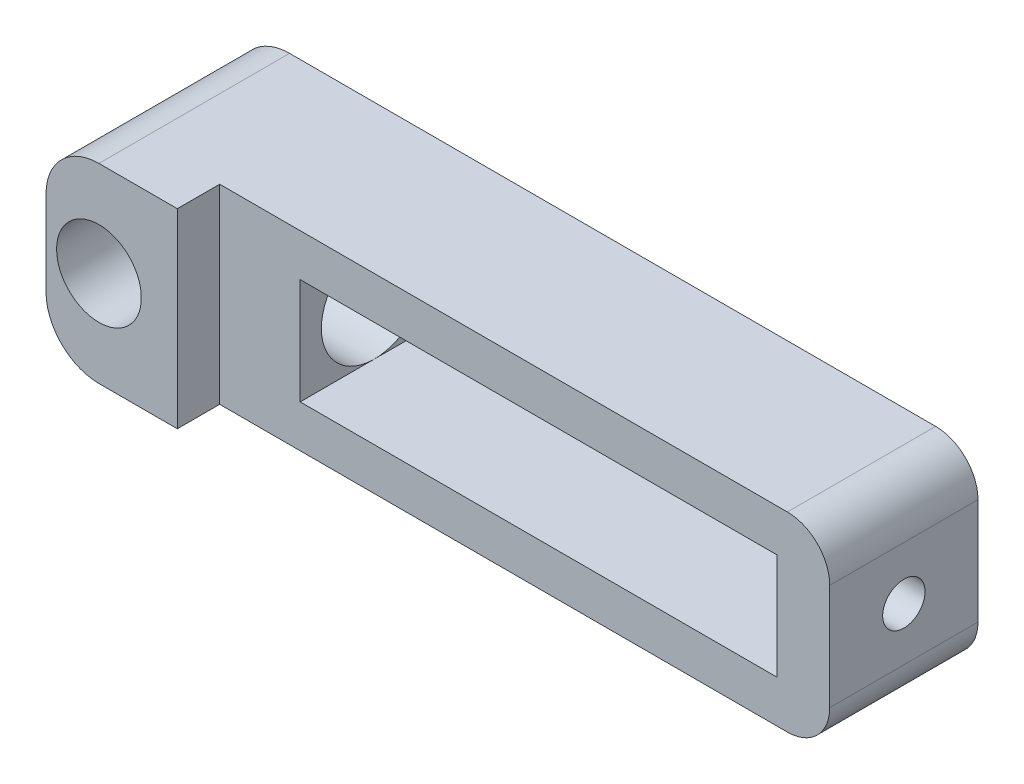
ISO-10303-21;
HEADER;
FILE_DESCRIPTION(('STEP AP214'),'2;1');
FILE_NAME('part.step','',(''),(''),'','','');
FILE_SCHEMA(('AUTOMOTIVE_DESIGN { 1 0 10303 214 1 1 1 1 }'));
ENDSEC;
DATA;
#1=APPLICATION_CONTEXT('core data for automotive mechanical design processes');
#2=APPLICATION_PROTOCOL_DEFINITION('international standard','automotive_design',2000,#1);
#3=PRODUCT_CONTEXT('',#1,'mechanical');
#4=PRODUCT('Part','Part','',(#3));
#5=PRODUCT_RELATED_PRODUCT_CATEGORY('part','',(#4));
#6=PRODUCT_DEFINITION_FORMATION('','',#4);
#7=PRODUCT_DEFINITION_CONTEXT('part definition',#1,'design');
#8=PRODUCT_DEFINITION('design','',#6,#7);
#9=PRODUCT_DEFINITION_SHAPE('','',#8);
#10=(LENGTH_UNIT() NAMED_UNIT(*) SI_UNIT(.MILLI.,.METRE.));
#11=(NAMED_UNIT(*) PLANE_ANGLE_UNIT() SI_UNIT($,.RADIAN.));
#12=(NAMED_UNIT(*) SI_UNIT($,.STERADIAN.) SOLID_ANGLE_UNIT());
#13=UNCERTAINTY_MEASURE_WITH_UNIT(LENGTH_MEASURE(1.E-05),#10,'distance_accuracy_value','');
#14=(GEOMETRIC_REPRESENTATION_CONTEXT(3) GLOBAL_UNCERTAINTY_ASSIGNED_CONTEXT((#13)) GLOBAL_UNIT_ASSIGNED_CONTEXT((#10,
#11,#12)) REPRESENTATION_CONTEXT('',''));
#15=CARTESIAN_POINT('',(0.,0.,0.));
#16=DIRECTION('',(0.,0.,1.));
#17=DIRECTION('',(1.,0.,0.));
#18=AXIS2_PLACEMENT_3D('',#15,#16,#17);
#19=CARTESIAN_POINT('',(0.,0.,7.));
#20=DIRECTION('',(1.,0.,0.));
#21=DIRECTION('',(0.,1.,0.));
#22=AXIS2_PLACEMENT_3D('',#19,#20,#21);
#23=PLANE('',#22);
#24=DIRECTION('',(0.,-1.,0.));
#25=VECTOR('',#24,1.);
#26=CARTESIAN_POINT('',(0.,-9.,9.));
#27=LINE('',#26,#25);
#28=CARTESIAN_POINT('',(0.,-2.5,9.));
#29=VERTEX_POINT('',#28);
#30=CARTESIAN_POINT('',(0.,-6.5,9.));
#31=VERTEX_POINT('',#30);
#32=EDGE_CURVE('E589',#29,#31,#27,.T.);
#33=ORIENTED_EDGE('',*,*,#32,.F.);
#34=DIRECTION('',(0.,0.,-1.));
#35=VECTOR('',#34,1.);
#36=CARTESIAN_POINT('',(0.,-2.5,7.));
#37=LINE('',#36,#35);
#38=CARTESIAN_POINT('',(0.,-2.5,5.));
#39=VERTEX_POINT('',#38);
#40=EDGE_CURVE('E386',#29,#39,#37,.T.);
#41=ORIENTED_EDGE('',*,*,#40,.T.);
#42=CARTESIAN_POINT('',(0.,-4.5,3.5));
#43=DIRECTION('',(1.,0.,0.));
#44=DIRECTION('',(0.,1.,0.));
#45=AXIS2_PLACEMENT_3D('',#42,#43,#44);
#46=CIRCLE('',#45,2.5);
#47=CARTESIAN_POINT('',(0.,-6.5,5.));
#48=VERTEX_POINT('',#47);
#49=EDGE_CURVE('E309',#48,#39,#46,.F.);
#50=ORIENTED_EDGE('',*,*,#49,.F.);
#51=DIRECTION('',(0.,0.,-1.));
#52=VECTOR('',#51,1.);
#53=CARTESIAN_POINT('',(0.,-6.5,7.));
#54=LINE('',#53,#52);
#55=EDGE_CURVE('E392',#48,#31,#54,.F.);
#56=ORIENTED_EDGE('',*,*,#55,.T.);
#57=EDGE_LOOP('',(#33,#41,#50,#56));
#58=FACE_BOUND('',#57,.T.);
#59=ADVANCED_FACE('F41',(#58),#23,.F.);
#60=CARTESIAN_POINT('',(10.,-2.,7.));
#61=DIRECTION('',(1.,0.,0.));
#62=DIRECTION('',(0.,0.,-1.));
#63=AXIS2_PLACEMENT_3D('',#60,#61,#62);
#64=PLANE('',#63);
#65=CARTESIAN_POINT('',(10.,-4.5,3.5));
#66=DIRECTION('',(1.,0.,0.));
#67=DIRECTION('',(0.,0.,-1.));
#68=AXIS2_PLACEMENT_3D('',#65,#66,#67);
#69=CIRCLE('',#68,2.5);
#70=CARTESIAN_POINT('',(10.,-2.,3.5));
#71=VERTEX_POINT('',#70);
#72=CARTESIAN_POINT('',(10.,-7.,3.5));
#73=VERTEX_POINT('',#72);
#74=EDGE_CURVE('E459',#71,#73,#69,.T.);
#75=ORIENTED_EDGE('',*,*,#74,.F.);
#76=DIRECTION('',(0.,0.,-1.));
#77=VECTOR('',#76,1.);
#78=CARTESIAN_POINT('',(10.,-2.,7.));
#79=LINE('',#78,#77);
#80=CARTESIAN_POINT('',(10.,-2.,7.));
#81=VERTEX_POINT('',#80);
#82=EDGE_CURVE('E260',#81,#71,#79,.T.);
#83=ORIENTED_EDGE('',*,*,#82,.F.);
#84=DIRECTION('',(0.,-1.,0.));
#85=VECTOR('',#84,1.);
#86=CARTESIAN_POINT('',(10.,-2.,7.));
#87=LINE('',#86,#85);
#88=CARTESIAN_POINT('',(10.,-7.,7.));
#89=VERTEX_POINT('',#88);
#90=EDGE_CURVE('E269',#81,#89,#87,.T.);
#91=ORIENTED_EDGE('',*,*,#90,.T.);
#92=DIRECTION('',(0.,0.,-1.));
#93=VECTOR('',#92,1.);
#94=CARTESIAN_POINT('',(10.,-7.,7.));
#95=LINE('',#94,#93);
#96=EDGE_CURVE('E236',#89,#73,#95,.T.);
#97=ORIENTED_EDGE('',*,*,#96,.T.);
#98=EDGE_LOOP('',(#75,#83,#91,#97));
#99=FACE_BOUND('',#98,.T.);
#100=ADVANCED_FACE('F345',(#99),#64,.T.);
#101=CARTESIAN_POINT('',(2.5,-4.5,7.));
#102=DIRECTION('',(0.,0.,-1.));
#103=DIRECTION('',(-1.,0.,0.));
#104=AXIS2_PLACEMENT_3D('',#101,#102,#103);
#105=CYLINDRICAL_SURFACE('',#104,2.);
#106=CARTESIAN_POINT('',(2.5,-4.5,9.));
#107=DIRECTION('',(0.,0.,-1.));
#108=DIRECTION('',(-1.,0.,0.));
#109=AXIS2_PLACEMENT_3D('',#106,#107,#108);
#110=CIRCLE('',#109,2.);
#111=CARTESIAN_POINT('',(0.5,-4.5,9.));
#112=VERTEX_POINT('',#111);
#113=EDGE_CURVE('E178',#112,#112,#110,.T.);
#114=ORIENTED_EDGE('',*,*,#113,.F.);
#115=EDGE_LOOP('',(#114));
#116=FACE_BOUND('',#115,.T.);
#117=CARTESIAN_POINT('',(0.5,-4.5,6.));
#118=CARTESIAN_POINT('',(0.500007579432928,-4.40400310356113,5.99999264947401));
#119=CARTESIAN_POINT('',(0.506969428663558,-4.30786680703533,5.99441368411908));
#120=CARTESIAN_POINT('',(0.534349940041729,-4.11868063452259,5.97259269360604));
#121=CARTESIAN_POINT('',(0.554798371261927,-4.02563806567866,5.95632708000382));
#122=CARTESIAN_POINT('',(0.607678278895069,-3.84590508317549,5.9146672181517));
#123=CARTESIAN_POINT('',(0.640033351431378,-3.75917830187195,5.88933120144167));
#124=CARTESIAN_POINT('',(0.715117343477346,-3.59307367630746,5.83136010996601));
#125=CARTESIAN_POINT('',(0.757846295850589,-3.51369585532849,5.79872501207752));
#126=CARTESIAN_POINT('',(0.868628365031063,-3.33681876343297,5.71575664728952));
#127=CARTESIAN_POINT('',(0.940318915174065,-3.24263232047885,5.66321748603216));
#128=CARTESIAN_POINT('',(1.0972780657395,-3.06958632172117,5.55292192603027));
#129=CARTESIAN_POINT('',(1.18258575350337,-2.99077238466846,5.49515072200505));
#130=CARTESIAN_POINT('',(1.36677398407267,-2.8478408104446,5.37856001629835));
#131=CARTESIAN_POINT('',(1.46584677297612,-2.78397361542778,5.31973830902028));
#132=CARTESIAN_POINT('',(1.67653878250419,-2.67353165586396,5.2088210988299));
#133=CARTESIAN_POINT('',(1.788114333888,-2.62689900613599,5.15670347089169));
#134=CARTESIAN_POINT('',(1.97387895167698,-2.56913956228181,5.08835652300928));
#135=CARTESIAN_POINT('',(2.04381173798029,-2.55134524179342,5.06628727770188));
#136=CARTESIAN_POINT('',(2.18721268412047,-2.52326603201669,5.03069889155832));
#137=CARTESIAN_POINT('',(2.260671673525,-2.51296268118224,5.0171587417974));
#138=CARTESIAN_POINT('',(2.41019251887104,-2.50060159857446,5.00084234061103));
#139=CARTESIAN_POINT('',(2.4862714848208,-2.49861654386577,4.99816096926556));
#140=CARTESIAN_POINT('',(2.63770489203275,-2.50330518300315,5.00439962302809));
#141=CARTESIAN_POINT('',(2.7130586657663,-2.50998620488913,5.01332946660241));
#142=CARTESIAN_POINT('',(2.87222230261273,-2.5330469728806,5.0432072129997));
#143=CARTESIAN_POINT('',(2.955508006054,-2.55078191794379,5.06581842049528));
#144=CARTESIAN_POINT('',(3.11653555953704,-2.59555452651152,5.11997459936279));
#145=CARTESIAN_POINT('',(3.19426015653982,-2.62261974357749,5.15154598198641));
#146=CARTESIAN_POINT('',(3.38066210604098,-2.70025897805923,5.23656116159416));
#147=CARTESIAN_POINT('',(3.48580269830419,-2.75585113404497,5.29313372968154));
#148=CARTESIAN_POINT('',(3.68371667779934,-2.88361532502463,5.40913780060687));
#149=CARTESIAN_POINT('',(3.77647172084354,-2.95581153097536,5.46857337048937));
#150=CARTESIAN_POINT('',(3.95127477140508,-3.11854181673604,5.58612751968448));
#151=CARTESIAN_POINT('',(4.03297192230577,-3.20951298973033,5.64416889260779));
#152=CARTESIAN_POINT('',(4.18009949943431,-3.40801508927334,5.75171871494995));
#153=CARTESIAN_POINT('',(4.24557351611724,-3.51550035479892,5.80124991822451));
#154=CARTESIAN_POINT('',(4.3405628474099,-3.71222218561944,5.87424585643318));
#155=CARTESIAN_POINT('',(4.37500450443907,-3.7978222726708,5.90111071224171));
#156=CARTESIAN_POINT('',(4.43212645098797,-3.97508607626285,5.94597564111417));
#157=CARTESIAN_POINT('',(4.45481560494548,-4.06674516372772,5.96398239496913));
#158=CARTESIAN_POINT('',(4.48713854693579,-4.25428676615508,5.98970335685206));
#159=CARTESIAN_POINT('',(4.49670412474496,-4.35018869278739,5.99736378633666));
#160=CARTESIAN_POINT('',(4.50185904897629,-4.54260800286752,6.00148682701864));
#161=CARTESIAN_POINT('',(4.49745099882206,-4.63912526832797,5.99795152409062));
#162=CARTESIAN_POINT('',(4.47591718375232,-4.82174667415546,5.98076858642945));
#163=CARTESIAN_POINT('',(4.45985082486099,-4.90806089175657,5.96796352405063));
#164=CARTESIAN_POINT('',(4.41712781889844,-5.07633567422872,5.93417513213473));
#165=CARTESIAN_POINT('',(4.39046802890338,-5.15829493885694,5.91318937553438));
#166=CARTESIAN_POINT('',(4.32584962821607,-5.32123587754891,5.86289849431328));
#167=CARTESIAN_POINT('',(4.28729421404364,-5.40184361941906,5.83315912736867));
#168=CARTESIAN_POINT('',(4.20113784836721,-5.55541000448331,5.76783622722139));
#169=CARTESIAN_POINT('',(4.15353644576545,-5.62836826593788,5.73225240258423));
#170=CARTESIAN_POINT('',(4.04077568170313,-5.77925237569143,5.64993687522397));
#171=CARTESIAN_POINT('',(3.973998309517,-5.85550718978129,5.6023696976822));
#172=CARTESIAN_POINT('',(3.83061303862901,-5.9965368759753,5.50443497952019));
#173=CARTESIAN_POINT('',(3.75397716316117,-6.06127777727367,5.45405970991097));
#174=CARTESIAN_POINT('',(3.62356555676341,-6.15568487930787,5.37374135317135));
#175=CARTESIAN_POINT('',(3.57263940924667,-6.18913741792652,5.34354743685463));
#176=CARTESIAN_POINT('',(3.4673777385764,-6.25155001920544,5.28435415521131));
#177=CARTESIAN_POINT('',(3.4130404281192,-6.28050769868976,5.25535542951891));
#178=CARTESIAN_POINT('',(3.30112515971834,-6.33358089959817,5.19983828792997));
#179=CARTESIAN_POINT('',(3.24356023275631,-6.35771431687655,5.17331090774834));
#180=CARTESIAN_POINT('',(3.12499102149601,-6.40088481958635,5.12410209867688));
#181=CARTESIAN_POINT('',(3.06398926248046,-6.4199255893155,5.10141789380427));
#182=CARTESIAN_POINT('',(2.9339132757622,-6.45360165889083,5.06019420222579));
#183=CARTESIAN_POINT('',(2.86457733505965,-6.46779559724999,5.04209716714775));
#184=CARTESIAN_POINT('',(2.72316238726194,-6.48878905619367,5.0149337159379));
#185=CARTESIAN_POINT('',(2.65109077954951,-6.49560723074758,5.00584452307525));
#186=CARTESIAN_POINT('',(2.50565129453592,-6.50132058716546,4.99824736779721));
#187=CARTESIAN_POINT('',(2.43227854584584,-6.50017319779789,4.99979625918437));
#188=CARTESIAN_POINT('',(2.28701580697689,-6.48996519544204,5.01330771695992));
#189=CARTESIAN_POINT('',(2.2151283526739,-6.48089203653787,5.02528679347387));
#190=CARTESIAN_POINT('',(2.05539322565544,-6.45207745752715,5.06207076756083));
#191=CARTESIAN_POINT('',(1.96857691750888,-6.43009230408642,5.0894925841937));
#192=CARTESIAN_POINT('',(1.80136652131036,-6.37608177217432,5.15288907642407));
#193=CARTESIAN_POINT('',(1.72099223996328,-6.34402681542564,5.18888887211293));
#194=CARTESIAN_POINT('',(1.58782227795385,-6.28094746311468,5.25491158724438));
#195=CARTESIAN_POINT('',(1.53348081848171,-6.25202363190409,5.28388907325008));
#196=CARTESIAN_POINT('',(1.42816177018274,-6.18964733782463,5.34307948739002));
#197=CARTESIAN_POINT('',(1.37718541504885,-6.15619322765903,5.37329286211508));
#198=CARTESIAN_POINT('',(1.22922059670118,-6.04918435570711,5.46437997758119));
#199=CARTESIAN_POINT('',(1.13720131333753,-5.9689854164051,5.52569808481402));
#200=CARTESIAN_POINT('',(0.966610535169238,-5.79001718858431,5.64418278787112));
#201=CARTESIAN_POINT('',(0.888229775763213,-5.69101966157648,5.701284919641));
#202=CARTESIAN_POINT('',(0.784423270583208,-5.52998399899547,5.77874650804527));
#203=CARTESIAN_POINT('',(0.752131555864879,-5.4742554001997,5.80318868109329));
#204=CARTESIAN_POINT('',(0.692631899038616,-5.35885482862805,5.84866115465602));
#205=CARTESIAN_POINT('',(0.665420845515494,-5.29918529980536,5.86969354228912));
#206=CARTESIAN_POINT('',(0.608219940104392,-5.15503773942425,5.91420905511499));
#207=CARTESIAN_POINT('',(0.58051732819907,-5.06911023959012,5.93602892887628));
#208=CARTESIAN_POINT('',(0.536842326612296,-4.89271309742772,5.97058864976841));
#209=CARTESIAN_POINT('',(0.520839211225404,-4.80225602410314,5.98335227816872));
#210=CARTESIAN_POINT('',(0.507436974439696,-4.67588093091991,5.99405378309104));
#211=CARTESIAN_POINT('',(0.504652621254229,-4.64080855282127,5.99627918763429));
#212=CARTESIAN_POINT('',(0.500932536472541,-4.57049707489183,5.999253810179));
#213=CARTESIAN_POINT('',(0.499997216210116,-4.53525793971173,6.00000269971647));
#214=CARTESIAN_POINT('',(0.5,-4.5,6.));
#215=B_SPLINE_CURVE_WITH_KNOTS('',3,(#117,#118,#119,#120,#121,#122,#123,#124,#125,#126,#127,
#128,#129,#130,#131,#132,#133,#134,#135,#136,#137,#138,#139,#140,#141,#142,#143,#144,#145,#146,
#147,#148,#149,#150,#151,#152,#153,#154,#155,#156,#157,#158,#159,#160,#161,#162,#163,#164,#165,
#166,#167,#168,#169,#170,#171,#172,#173,#174,#175,#176,#177,#178,#179,#180,#181,#182,#183,#184,
#185,#186,#187,#188,#189,#190,#191,#192,#193,#194,#195,#196,#197,#198,#199,#200,#201,#202,#203,
#204,#205,#206,#207,#208,#209,#210,#211,#212,#213,#214),.UNSPECIFIED.,.T.,.F.,(4,2,2,2,2,2,2,2,
2,2,2,2,2,2,2,2,2,2,2,2,2,2,2,2,2,2,2,2,2,2,2,2,2,2,2,2,2,2,2,2,2,2,2,2,2,2,2,2,4),(0.,
0.287836605992208,0.576310692639342,0.862965057250605,1.14962032997081,1.53607888200101,
1.92366738187851,2.31734741765481,2.70969292925127,2.9353448634113,3.16043877408111,
3.38749528500759,3.61474392028823,3.87758630032011,4.14121163495706,4.53425748188301,
4.92787915886674,5.3319817328842,5.73498644040677,6.02213978124803,6.30907621738868,
6.59749843639965,6.88586692268772,7.1508700493816,7.41595185759573,7.69742753051566,
7.9789172435135,8.31365537249325,8.64936529970902,8.85316560745906,9.05707360380851,
9.26021055202079,9.46320013996582,9.68152133432597,9.89928907450684,10.1182215471168,
10.3375012031536,10.616933053181,10.8971934831173,11.1010640012511,11.3050088506911,
11.7129165318148,12.1261363563906,12.3324811048119,12.5386990694968,12.8161540735935,
13.0928777702216,13.1985714874516,13.3042887145431),.UNSPECIFIED.);
#216=CARTESIAN_POINT('',(0.5,-4.5,6.));
#217=VERTEX_POINT('',#216);
#218=EDGE_CURVE('E320',#217,#217,#215,.T.);
#219=ORIENTED_EDGE('',*,*,#218,.T.);
#220=EDGE_LOOP('',(#219));
#221=FACE_BOUND('',#220,.T.);
#222=ADVANCED_FACE('F352',(#116,#221),#105,.F.);
#223=CARTESIAN_POINT('',(0.,-9.,7.));
#224=DIRECTION('',(0.,0.,1.));
#225=DIRECTION('',(1.,0.,0.));
#226=AXIS2_PLACEMENT_3D('',#223,#224,#225);
#227=PLANE('',#226);
#228=DIRECTION('',(1.,0.,0.));
#229=VECTOR('',#228,1.);
#230=CARTESIAN_POINT('',(0.,-9.,7.));
#231=LINE('',#230,#229);
#232=CARTESIAN_POINT('',(6.2,-9.,7.));
#233=VERTEX_POINT('',#232);
#234=CARTESIAN_POINT('',(33.,-9.,7.));
#235=VERTEX_POINT('',#234);
#236=EDGE_CURVE('E245',#233,#235,#231,.T.);
#237=ORIENTED_EDGE('',*,*,#236,.T.);
#238=CARTESIAN_POINT('',(33.,-7.,7.));
#239=DIRECTION('',(0.,0.,1.));
#240=DIRECTION('',(1.,0.,0.));
#241=AXIS2_PLACEMENT_3D('',#238,#239,#240);
#242=CIRCLE('',#241,2.);
#243=CARTESIAN_POINT('',(35.,-7.,7.));
#244=VERTEX_POINT('',#243);
#245=EDGE_CURVE('E420',#235,#244,#242,.T.);
#246=ORIENTED_EDGE('',*,*,#245,.T.);
#247=DIRECTION('',(0.,1.,0.));
#248=VECTOR('',#247,1.);
#249=CARTESIAN_POINT('',(35.,0.,7.));
#250=LINE('',#249,#248);
#251=CARTESIAN_POINT('',(35.,-2.,7.));
#252=VERTEX_POINT('',#251);
#253=EDGE_CURVE('E226',#244,#252,#250,.T.);
#254=ORIENTED_EDGE('',*,*,#253,.T.);
#255=CARTESIAN_POINT('',(33.,-2.,7.));
#256=DIRECTION('',(0.,0.,1.));
#257=DIRECTION('',(1.,0.,0.));
#258=AXIS2_PLACEMENT_3D('',#255,#256,#257);
#259=CIRCLE('',#258,2.);
#260=CARTESIAN_POINT('',(33.,0.,7.));
#261=VERTEX_POINT('',#260);
#262=EDGE_CURVE('E222',#252,#261,#259,.T.);
#263=ORIENTED_EDGE('',*,*,#262,.T.);
#264=DIRECTION('',(-1.,0.,0.));
#265=VECTOR('',#264,1.);
#266=CARTESIAN_POINT('',(0.,0.,7.));
#267=LINE('',#266,#265);
#268=CARTESIAN_POINT('',(6.2,0.,7.));
#269=VERTEX_POINT('',#268);
#270=EDGE_CURVE('E208',#261,#269,#267,.T.);
#271=ORIENTED_EDGE('',*,*,#270,.T.);
#272=DIRECTION('',(0.,1.,0.));
#273=VECTOR('',#272,1.);
#274=CARTESIAN_POINT('',(6.2,0.,7.));
#275=LINE('',#274,#273);
#276=EDGE_CURVE('E183',#233,#269,#275,.T.);
#277=ORIENTED_EDGE('',*,*,#276,.F.);
#278=EDGE_LOOP('',(#237,#246,#254,#263,#271,#277));
#279=FACE_BOUND('',#278,.T.);
#280=DIRECTION('',(1.,0.,0.));
#281=VECTOR('',#280,1.);
#282=CARTESIAN_POINT('',(10.,-7.,7.));
#283=LINE('',#282,#281);
#284=CARTESIAN_POINT('',(32.5,-7.,7.));
#285=VERTEX_POINT('',#284);
#286=EDGE_CURVE('E289',#89,#285,#283,.T.);
#287=ORIENTED_EDGE('',*,*,#286,.F.);
#288=ORIENTED_EDGE('',*,*,#90,.F.);
#289=DIRECTION('',(-1.,0.,0.));
#290=VECTOR('',#289,1.);
#291=CARTESIAN_POINT('',(10.,-2.,7.));
#292=LINE('',#291,#290);
#293=CARTESIAN_POINT('',(32.5,-2.,7.));
#294=VERTEX_POINT('',#293);
#295=EDGE_CURVE('E282',#294,#81,#292,.T.);
#296=ORIENTED_EDGE('',*,*,#295,.F.);
#297=DIRECTION('',(0.,1.,0.));
#298=VECTOR('',#297,1.);
#299=CARTESIAN_POINT('',(32.5,-2.,7.));
#300=LINE('',#299,#298);
#301=EDGE_CURVE('E285',#285,#294,#300,.T.);
#302=ORIENTED_EDGE('',*,*,#301,.F.);
#303=EDGE_LOOP('',(#287,#288,#296,#302));
#304=FACE_BOUND('',#303,.T.);
#305=ADVANCED_FACE('F369',(#279,#304),#227,.T.);
#306=CARTESIAN_POINT('',(0.,-9.,0.));
#307=DIRECTION('',(0.,0.,1.));
#308=DIRECTION('',(1.,0.,0.));
#309=AXIS2_PLACEMENT_3D('',#306,#307,#308);
#310=PLANE('',#309);
#311=DIRECTION('',(0.,-1.,0.));
#312=VECTOR('',#311,1.);
#313=CARTESIAN_POINT('',(0.,0.,0.));
#314=LINE('',#313,#312);
#315=CARTESIAN_POINT('',(0.,-2.5,0.));
#316=VERTEX_POINT('',#315);
#317=CARTESIAN_POINT('',(0.,-6.5,0.));
#318=VERTEX_POINT('',#317);
#319=EDGE_CURVE('E231',#316,#318,#314,.T.);
#320=ORIENTED_EDGE('',*,*,#319,.F.);
#321=CARTESIAN_POINT('',(2.5,-2.5,0.));
#322=DIRECTION('',(0.,0.,1.));
#323=DIRECTION('',(1.,0.,0.));
#324=AXIS2_PLACEMENT_3D('',#321,#322,#323);
#325=CIRCLE('',#324,2.5);
#326=CARTESIAN_POINT('',(2.5,0.,0.));
#327=VERTEX_POINT('',#326);
#328=EDGE_CURVE('E384',#316,#327,#325,.F.);
#329=ORIENTED_EDGE('',*,*,#328,.T.);
#330=DIRECTION('',(-1.,0.,0.));
#331=VECTOR('',#330,1.);
#332=CARTESIAN_POINT('',(0.,0.,0.));
#333=LINE('',#332,#331);
#334=CARTESIAN_POINT('',(33.,0.,0.));
#335=VERTEX_POINT('',#334);
#336=EDGE_CURVE('E243',#335,#327,#333,.T.);
#337=ORIENTED_EDGE('',*,*,#336,.F.);
#338=CARTESIAN_POINT('',(33.,-2.,0.));
#339=DIRECTION('',(0.,0.,1.));
#340=DIRECTION('',(1.,0.,0.));
#341=AXIS2_PLACEMENT_3D('',#338,#339,#340);
#342=CIRCLE('',#341,2.);
#343=CARTESIAN_POINT('',(35.,-2.,0.));
#344=VERTEX_POINT('',#343);
#345=EDGE_CURVE('E212',#335,#344,#342,.F.);
#346=ORIENTED_EDGE('',*,*,#345,.T.);
#347=DIRECTION('',(0.,1.,0.));
#348=VECTOR('',#347,1.);
#349=CARTESIAN_POINT('',(35.,0.,0.));
#350=LINE('',#349,#348);
#351=CARTESIAN_POINT('',(35.,-7.,0.));
#352=VERTEX_POINT('',#351);
#353=EDGE_CURVE('E239',#352,#344,#350,.T.);
#354=ORIENTED_EDGE('',*,*,#353,.F.);
#355=CARTESIAN_POINT('',(33.,-7.,0.));
#356=DIRECTION('',(0.,0.,1.));
#357=DIRECTION('',(1.,0.,0.));
#358=AXIS2_PLACEMENT_3D('',#355,#356,#357);
#359=CIRCLE('',#358,2.);
#360=CARTESIAN_POINT('',(33.,-9.,0.));
#361=VERTEX_POINT('',#360);
#362=EDGE_CURVE('E215',#352,#361,#359,.F.);
#363=ORIENTED_EDGE('',*,*,#362,.T.);
#364=DIRECTION('',(1.,0.,0.));
#365=VECTOR('',#364,1.);
#366=CARTESIAN_POINT('',(0.,-9.,0.));
#367=LINE('',#366,#365);
#368=CARTESIAN_POINT('',(2.5,-9.,0.));
#369=VERTEX_POINT('',#368);
#370=EDGE_CURVE('E235',#369,#361,#367,.T.);
#371=ORIENTED_EDGE('',*,*,#370,.F.);
#372=CARTESIAN_POINT('',(2.5,-6.5,0.));
#373=DIRECTION('',(0.,0.,1.));
#374=DIRECTION('',(1.,0.,0.));
#375=AXIS2_PLACEMENT_3D('',#372,#373,#374);
#376=CIRCLE('',#375,2.5);
#377=EDGE_CURVE('E407',#369,#318,#376,.F.);
#378=ORIENTED_EDGE('',*,*,#377,.T.);
#379=EDGE_LOOP('',(#320,#329,#337,#346,#354,#363,#371,#378));
#380=FACE_BOUND('',#379,.T.);
#381=DIRECTION('',(0.,-1.,0.));
#382=VECTOR('',#381,1.);
#383=CARTESIAN_POINT('',(10.,-2.,0.));
#384=LINE('',#383,#382);
#385=CARTESIAN_POINT('',(10.,-2.,0.));
#386=VERTEX_POINT('',#385);
#387=CARTESIAN_POINT('',(10.,-7.,0.));
#388=VERTEX_POINT('',#387);
#389=EDGE_CURVE('E278',#386,#388,#384,.T.);
#390=ORIENTED_EDGE('',*,*,#389,.T.);
#391=DIRECTION('',(1.,0.,0.));
#392=VECTOR('',#391,1.);
#393=CARTESIAN_POINT('',(10.,-7.,0.));
#394=LINE('',#393,#392);
#395=CARTESIAN_POINT('',(32.5,-7.,0.));
#396=VERTEX_POINT('',#395);
#397=EDGE_CURVE('E274',#388,#396,#394,.T.);
#398=ORIENTED_EDGE('',*,*,#397,.T.);
#399=DIRECTION('',(0.,1.,0.));
#400=VECTOR('',#399,1.);
#401=CARTESIAN_POINT('',(32.5,-2.,0.));
#402=LINE('',#401,#400);
#403=CARTESIAN_POINT('',(32.5,-2.,0.));
#404=VERTEX_POINT('',#403);
#405=EDGE_CURVE('E270',#396,#404,#402,.T.);
#406=ORIENTED_EDGE('',*,*,#405,.T.);
#407=DIRECTION('',(-1.,0.,0.));
#408=VECTOR('',#407,1.);
#409=CARTESIAN_POINT('',(10.,-2.,0.));
#410=LINE('',#409,#408);
#411=EDGE_CURVE('E265',#404,#386,#410,.T.);
#412=ORIENTED_EDGE('',*,*,#411,.T.);
#413=EDGE_LOOP('',(#390,#398,#406,#412));
#414=FACE_BOUND('',#413,.T.);
#415=CARTESIAN_POINT('',(2.5,-4.5,0.));
#416=DIRECTION('',(0.,0.,1.));
#417=DIRECTION('',(1.,0.,0.));
#418=AXIS2_PLACEMENT_3D('',#415,#416,#417);
#419=CIRCLE('',#418,2.);
#420=CARTESIAN_POINT('',(4.5,-4.5,0.));
#421=VERTEX_POINT('',#420);
#422=EDGE_CURVE('E189',#421,#421,#419,.T.);
#423=ORIENTED_EDGE('',*,*,#422,.T.);
#424=EDGE_LOOP('',(#423));
#425=FACE_BOUND('',#424,.T.);
#426=ADVANCED_FACE('F361',(#380,#414,#425),#310,.F.);
#427=CARTESIAN_POINT('',(0.,-2.5,2.));
#428=VERTEX_POINT('',#427);
#429=CARTESIAN_POINT('',(0.,-6.5,2.));
#430=VERTEX_POINT('',#429);
#431=EDGE_CURVE('E305',#428,#430,#46,.F.);
#432=ORIENTED_EDGE('',*,*,#431,.F.);
#433=DIRECTION('',(0.,0.,-1.));
#434=VECTOR('',#433,1.);
#435=CARTESIAN_POINT('',(0.,-2.5,7.));
#436=LINE('',#435,#434);
#437=EDGE_CURVE('E374',#428,#316,#436,.T.);
#438=ORIENTED_EDGE('',*,*,#437,.T.);
#439=ORIENTED_EDGE('',*,*,#319,.T.);
#440=DIRECTION('',(0.,0.,-1.));
#441=VECTOR('',#440,1.);
#442=CARTESIAN_POINT('',(0.,-6.5,7.));
#443=LINE('',#442,#441);
#444=EDGE_CURVE('E377',#318,#430,#443,.F.);
#445=ORIENTED_EDGE('',*,*,#444,.T.);
#446=EDGE_LOOP('',(#432,#438,#439,#445));
#447=FACE_BOUND('',#446,.T.);
#448=ADVANCED_FACE('F348',(#447),#23,.F.);
#449=CARTESIAN_POINT('',(0.,-9.,7.));
#450=DIRECTION('',(0.,1.,0.));
#451=DIRECTION('',(0.,0.,1.));
#452=AXIS2_PLACEMENT_3D('',#449,#450,#451);
#453=PLANE('',#452);
#454=DIRECTION('',(1.,0.,0.));
#455=VECTOR('',#454,1.);
#456=CARTESIAN_POINT('',(0.,-9.,9.));
#457=LINE('',#456,#455);
#458=CARTESIAN_POINT('',(2.5,-9.,9.));
#459=VERTEX_POINT('',#458);
#460=CARTESIAN_POINT('',(6.2,-9.,9.));
#461=VERTEX_POINT('',#460);
#462=EDGE_CURVE('E167',#459,#461,#457,.T.);
#463=ORIENTED_EDGE('',*,*,#462,.F.);
#464=DIRECTION('',(0.,0.,-1.));
#465=VECTOR('',#464,1.);
#466=CARTESIAN_POINT('',(2.5,-9.,7.));
#467=LINE('',#466,#465);
#468=EDGE_CURVE('E11',#459,#369,#467,.T.);
#469=ORIENTED_EDGE('',*,*,#468,.T.);
#470=ORIENTED_EDGE('',*,*,#370,.T.);
#471=DIRECTION('',(0.,0.,-1.));
#472=VECTOR('',#471,1.);
#473=CARTESIAN_POINT('',(33.,-9.,7.));
#474=LINE('',#473,#472);
#475=EDGE_CURVE('E219',#361,#235,#474,.F.);
#476=ORIENTED_EDGE('',*,*,#475,.T.);
#477=ORIENTED_EDGE('',*,*,#236,.F.);
#478=DIRECTION('',(0.,0.,-1.));
#479=VECTOR('',#478,1.);
#480=CARTESIAN_POINT('',(6.2,-9.,11.5));
#481=LINE('',#480,#479);
#482=EDGE_CURVE('E185',#461,#233,#481,.T.);
#483=ORIENTED_EDGE('',*,*,#482,.F.);
#484=EDGE_LOOP('',(#463,#469,#470,#476,#477,#483));
#485=FACE_BOUND('',#484,.T.);
#486=ADVANCED_FACE('F360',(#485),#453,.F.);
#487=CARTESIAN_POINT('',(35.,0.,7.));
#488=DIRECTION('',(-1.,0.,0.));
#489=DIRECTION('',(0.,0.,1.));
#490=AXIS2_PLACEMENT_3D('',#487,#488,#489);
#491=PLANE('',#490);
#492=CARTESIAN_POINT('',(35.,-4.5,3.5));
#493=DIRECTION('',(1.,0.,0.));
#494=DIRECTION('',(0.,0.,-1.));
#495=AXIS2_PLACEMENT_3D('',#492,#493,#494);
#496=CIRCLE('',#495,1.);
#497=CARTESIAN_POINT('',(35.,-4.5,2.5));
#498=VERTEX_POINT('',#497);
#499=EDGE_CURVE('E191',#498,#498,#496,.T.);
#500=ORIENTED_EDGE('',*,*,#499,.F.);
#501=EDGE_LOOP('',(#500));
#502=FACE_BOUND('',#501,.T.);
#503=ORIENTED_EDGE('',*,*,#253,.F.);
#504=DIRECTION('',(0.,0.,-1.));
#505=VECTOR('',#504,1.);
#506=CARTESIAN_POINT('',(35.,-7.,7.));
#507=LINE('',#506,#505);
#508=EDGE_CURVE('E207',#244,#352,#507,.T.);
#509=ORIENTED_EDGE('',*,*,#508,.T.);
#510=ORIENTED_EDGE('',*,*,#353,.T.);
#511=DIRECTION('',(0.,0.,-1.));
#512=VECTOR('',#511,1.);
#513=CARTESIAN_POINT('',(35.,-2.,7.));
#514=LINE('',#513,#512);
#515=EDGE_CURVE('E204',#344,#252,#514,.F.);
#516=ORIENTED_EDGE('',*,*,#515,.T.);
#517=EDGE_LOOP('',(#503,#509,#510,#516));
#518=FACE_BOUND('',#517,.T.);
#519=ADVANCED_FACE('F367',(#502,#518),#491,.F.);
#520=CARTESIAN_POINT('',(0.,0.,7.));
#521=DIRECTION('',(0.,-1.,0.));
#522=DIRECTION('',(0.,0.,-1.));
#523=AXIS2_PLACEMENT_3D('',#520,#521,#522);
#524=PLANE('',#523);
#525=ORIENTED_EDGE('',*,*,#336,.T.);
#526=DIRECTION('',(0.,0.,-1.));
#527=VECTOR('',#526,1.);
#528=CARTESIAN_POINT('',(2.5,0.,7.));
#529=LINE('',#528,#527);
#530=CARTESIAN_POINT('',(2.5,0.,9.));
#531=VERTEX_POINT('',#530);
#532=EDGE_CURVE('E66',#327,#531,#529,.F.);
#533=ORIENTED_EDGE('',*,*,#532,.T.);
#534=DIRECTION('',(-1.,0.,0.));
#535=VECTOR('',#534,1.);
#536=CARTESIAN_POINT('',(0.,0.,9.));
#537=LINE('',#536,#535);
#538=CARTESIAN_POINT('',(6.2,0.,9.));
#539=VERTEX_POINT('',#538);
#540=EDGE_CURVE('E165',#539,#531,#537,.T.);
#541=ORIENTED_EDGE('',*,*,#540,.F.);
#542=DIRECTION('',(0.,0.,-1.));
#543=VECTOR('',#542,1.);
#544=CARTESIAN_POINT('',(6.2,0.,11.5));
#545=LINE('',#544,#543);
#546=EDGE_CURVE('E175',#539,#269,#545,.T.);
#547=ORIENTED_EDGE('',*,*,#546,.T.);
#548=ORIENTED_EDGE('',*,*,#270,.F.);
#549=DIRECTION('',(0.,0.,-1.));
#550=VECTOR('',#549,1.);
#551=CARTESIAN_POINT('',(33.,0.,7.));
#552=LINE('',#551,#550);
#553=EDGE_CURVE('E195',#261,#335,#552,.T.);
#554=ORIENTED_EDGE('',*,*,#553,.T.);
#555=EDGE_LOOP('',(#525,#533,#541,#547,#548,#554));
#556=FACE_BOUND('',#555,.T.);
#557=ADVANCED_FACE('F173',(#556),#524,.F.);
#558=EDGE_CURVE('E319',#73,#71,#69,.T.);
#559=ORIENTED_EDGE('',*,*,#558,.F.);
#560=EDGE_CURVE('E253',#73,#388,#95,.T.);
#561=ORIENTED_EDGE('',*,*,#560,.T.);
#562=ORIENTED_EDGE('',*,*,#389,.F.);
#563=EDGE_CURVE('E264',#71,#386,#79,.T.);
#564=ORIENTED_EDGE('',*,*,#563,.F.);
#565=EDGE_LOOP('',(#559,#561,#562,#564));
#566=FACE_BOUND('',#565,.T.);
#567=ADVANCED_FACE('F355',(#566),#64,.T.);
#568=CARTESIAN_POINT('',(10.,-7.,7.));
#569=DIRECTION('',(0.,1.,0.));
#570=DIRECTION('',(0.,0.,1.));
#571=AXIS2_PLACEMENT_3D('',#568,#569,#570);
#572=PLANE('',#571);
#573=ORIENTED_EDGE('',*,*,#397,.F.);
#574=ORIENTED_EDGE('',*,*,#560,.F.);
#575=ORIENTED_EDGE('',*,*,#96,.F.);
#576=ORIENTED_EDGE('',*,*,#286,.T.);
#577=DIRECTION('',(0.,0.,-1.));
#578=VECTOR('',#577,1.);
#579=CARTESIAN_POINT('',(32.5,-7.,7.));
#580=LINE('',#579,#578);
#581=EDGE_CURVE('E254',#285,#396,#580,.T.);
#582=ORIENTED_EDGE('',*,*,#581,.T.);
#583=EDGE_LOOP('',(#573,#574,#575,#576,#582));
#584=FACE_BOUND('',#583,.T.);
#585=ADVANCED_FACE('F462',(#584),#572,.T.);
#586=CARTESIAN_POINT('',(32.5,-2.,7.));
#587=DIRECTION('',(-1.,0.,0.));
#588=DIRECTION('',(0.,0.,1.));
#589=AXIS2_PLACEMENT_3D('',#586,#587,#588);
#590=PLANE('',#589);
#591=CARTESIAN_POINT('',(32.5,-4.5,3.5));
#592=DIRECTION('',(-1.,0.,0.));
#593=DIRECTION('',(0.,0.,1.));
#594=AXIS2_PLACEMENT_3D('',#591,#592,#593);
#595=CIRCLE('',#594,1.);
#596=CARTESIAN_POINT('',(32.5,-4.5,4.5));
#597=VERTEX_POINT('',#596);
#598=EDGE_CURVE('E301',#597,#597,#595,.F.);
#599=ORIENTED_EDGE('',*,*,#598,.T.);
#600=EDGE_LOOP('',(#599));
#601=FACE_BOUND('',#600,.T.);
#602=ORIENTED_EDGE('',*,*,#405,.F.);
#603=ORIENTED_EDGE('',*,*,#581,.F.);
#604=ORIENTED_EDGE('',*,*,#301,.T.);
#605=DIRECTION('',(0.,0.,-1.));
#606=VECTOR('',#605,1.);
#607=CARTESIAN_POINT('',(32.5,-2.,7.));
#608=LINE('',#607,#606);
#609=EDGE_CURVE('E257',#294,#404,#608,.T.);
#610=ORIENTED_EDGE('',*,*,#609,.T.);
#611=EDGE_LOOP('',(#602,#603,#604,#610));
#612=FACE_BOUND('',#611,.T.);
#613=ADVANCED_FACE('F453',(#601,#612),#590,.T.);
#614=CARTESIAN_POINT('',(10.,-2.,7.));
#615=DIRECTION('',(0.,-1.,0.));
#616=DIRECTION('',(0.,0.,-1.));
#617=AXIS2_PLACEMENT_3D('',#614,#615,#616);
#618=PLANE('',#617);
#619=ORIENTED_EDGE('',*,*,#411,.F.);
#620=ORIENTED_EDGE('',*,*,#609,.F.);
#621=ORIENTED_EDGE('',*,*,#295,.T.);
#622=ORIENTED_EDGE('',*,*,#82,.T.);
#623=ORIENTED_EDGE('',*,*,#563,.T.);
#624=EDGE_LOOP('',(#619,#620,#621,#622,#623));
#625=FACE_BOUND('',#624,.T.);
#626=ADVANCED_FACE('F443',(#625),#618,.T.);
#627=CARTESIAN_POINT('',(0.5,-4.5,1.));
#628=CARTESIAN_POINT('',(0.500007579432928,-4.59599689643887,1.00000735052599));
#629=CARTESIAN_POINT('',(0.506969428663558,-4.69213319296467,1.00558631588092));
#630=CARTESIAN_POINT('',(0.534349940041729,-4.88131936547741,1.02740730639396));
#631=CARTESIAN_POINT('',(0.554798371261927,-4.97436193432134,1.04367291999618));
#632=CARTESIAN_POINT('',(0.607678278895069,-5.15409491682451,1.0853327818483));
#633=CARTESIAN_POINT('',(0.640033351431378,-5.24082169812805,1.11066879855833));
#634=CARTESIAN_POINT('',(0.715117343477346,-5.40692632369254,1.16863989003399));
#635=CARTESIAN_POINT('',(0.757846295850589,-5.4863041446715,1.20127498792248));
#636=CARTESIAN_POINT('',(0.868628365031063,-5.66318123656703,1.28424335271048));
#637=CARTESIAN_POINT('',(0.940318915174064,-5.75736767952115,1.33678251396784));
#638=CARTESIAN_POINT('',(1.0972780657395,-5.93041367827883,1.44707807396973));
#639=CARTESIAN_POINT('',(1.18258575350337,-6.00922761533153,1.50484927799495));
#640=CARTESIAN_POINT('',(1.36677398407267,-6.1521591895554,1.62143998370165));
#641=CARTESIAN_POINT('',(1.46584677297612,-6.21602638457221,1.68026169097972));
#642=CARTESIAN_POINT('',(1.67653878250419,-6.32646834413604,1.7911789011701));
#643=CARTESIAN_POINT('',(1.78811433388799,-6.37310099386401,1.84329652910831));
#644=CARTESIAN_POINT('',(1.97387895167698,-6.43086043771819,1.91164347699072));
#645=CARTESIAN_POINT('',(2.04381173798029,-6.44865475820658,1.93371272229811));
#646=CARTESIAN_POINT('',(2.18721268412047,-6.47673396798331,1.96930110844168));
#647=CARTESIAN_POINT('',(2.26067167352499,-6.48703731881776,1.9828412582026));
#648=CARTESIAN_POINT('',(2.41019251887104,-6.49939840142554,1.99915765938897));
#649=CARTESIAN_POINT('',(2.48627148482079,-6.50138345613423,2.00183903073444));
#650=CARTESIAN_POINT('',(2.63770489203274,-6.49669481699685,1.99560037697191));
#651=CARTESIAN_POINT('',(2.7130586657663,-6.49001379511087,1.98667053339759));
#652=CARTESIAN_POINT('',(2.87222230261273,-6.4669530271194,1.9567927870003));
#653=CARTESIAN_POINT('',(2.955508006054,-6.44921808205621,1.93418157950472));
#654=CARTESIAN_POINT('',(3.11653555953703,-6.40444547348848,1.88002540063721));
#655=CARTESIAN_POINT('',(3.19426015653982,-6.37738025642251,1.84845401801359));
#656=CARTESIAN_POINT('',(3.38066210604098,-6.29974102194077,1.76343883840584));
#657=CARTESIAN_POINT('',(3.48580269830419,-6.24414886595503,1.70686627031847));
#658=CARTESIAN_POINT('',(3.68371667779934,-6.11638467497537,1.59086219939313));
#659=CARTESIAN_POINT('',(3.77647172084354,-6.04418846902464,1.53142662951063));
#660=CARTESIAN_POINT('',(3.95127477140508,-5.88145818326396,1.41387248031552));
#661=CARTESIAN_POINT('',(4.03297192230577,-5.79048701026967,1.35583110739221));
#662=CARTESIAN_POINT('',(4.18009949943431,-5.59198491072666,1.24828128505006));
#663=CARTESIAN_POINT('',(4.24557351611723,-5.48449964520108,1.19875008177549));
#664=CARTESIAN_POINT('',(4.3405628474099,-5.28777781438056,1.12575414356682));
#665=CARTESIAN_POINT('',(4.37500450443907,-5.20217772732921,1.09888928775829));
#666=CARTESIAN_POINT('',(4.43212645098797,-5.02491392373715,1.05402435888583));
#667=CARTESIAN_POINT('',(4.45481560494548,-4.93325483627228,1.03601760503087));
#668=CARTESIAN_POINT('',(4.48713854693579,-4.74571323384493,1.01029664314794));
#669=CARTESIAN_POINT('',(4.49670412474496,-4.64981130721262,1.00263621366334));
#670=CARTESIAN_POINT('',(4.50185904897629,-4.45739199713248,0.998513172981361));
#671=CARTESIAN_POINT('',(4.49745099882206,-4.36087473167204,1.00204847590938));
#672=CARTESIAN_POINT('',(4.47591718375232,-4.17825332584454,1.01923141357055));
#673=CARTESIAN_POINT('',(4.45985082486099,-4.09193910824343,1.03203647594937));
#674=CARTESIAN_POINT('',(4.41712781889844,-3.92366432577128,1.06582486786527));
#675=CARTESIAN_POINT('',(4.39046802890338,-3.84170506114306,1.08681062446562));
#676=CARTESIAN_POINT('',(4.32584962821607,-3.67876412245109,1.13710150568672));
#677=CARTESIAN_POINT('',(4.28729421404364,-3.59815638058095,1.16684087263133));
#678=CARTESIAN_POINT('',(4.20113784836721,-3.44458999551669,1.2321637727786));
#679=CARTESIAN_POINT('',(4.15353644576545,-3.37163173406212,1.26774759741577));
#680=CARTESIAN_POINT('',(4.04077568170313,-3.22074762430857,1.35006312477603));
#681=CARTESIAN_POINT('',(3.973998309517,-3.14449281021871,1.3976303023178));
#682=CARTESIAN_POINT('',(3.83061303862902,-3.0034631240247,1.49556502047981));
#683=CARTESIAN_POINT('',(3.75397716316117,-2.93872222272633,1.54594029008903));
#684=CARTESIAN_POINT('',(3.62356555676341,-2.84431512069213,1.62625864682865));
#685=CARTESIAN_POINT('',(3.57263940924667,-2.81086258207348,1.65645256314537));
#686=CARTESIAN_POINT('',(3.46737773857641,-2.74844998079456,1.71564584478869));
#687=CARTESIAN_POINT('',(3.41304042811921,-2.71949230131024,1.74464457048109));
#688=CARTESIAN_POINT('',(3.30112515971834,-2.66641910040183,1.80016171207003));
#689=CARTESIAN_POINT('',(3.24356023275631,-2.64228568312345,1.82668909225166));
#690=CARTESIAN_POINT('',(3.12499102149601,-2.59911518041365,1.87589790132311));
#691=CARTESIAN_POINT('',(3.06398926248046,-2.5800744106845,1.89858210619573));
#692=CARTESIAN_POINT('',(2.9339132757622,-2.54639834110917,1.9398057977742));
#693=CARTESIAN_POINT('',(2.86457733505965,-2.53220440275001,1.95790283285225));
#694=CARTESIAN_POINT('',(2.72316238726195,-2.51121094380633,1.9850662840621));
#695=CARTESIAN_POINT('',(2.65109077954951,-2.50439276925242,1.99415547692475));
#696=CARTESIAN_POINT('',(2.50565129453592,-2.49867941283454,2.00175263220279));
#697=CARTESIAN_POINT('',(2.43227854584584,-2.4998268022021,2.00020374081563));
#698=CARTESIAN_POINT('',(2.2870158069769,-2.51003480455796,1.98669228304008));
#699=CARTESIAN_POINT('',(2.2151283526739,-2.51910796346213,1.97471320652613));
#700=CARTESIAN_POINT('',(2.05539322565544,-2.54792254247285,1.93792923243917));
#701=CARTESIAN_POINT('',(1.96857691750888,-2.56990769591358,1.9105074158063));
#702=CARTESIAN_POINT('',(1.80136652131036,-2.62391822782568,1.84711092357593));
#703=CARTESIAN_POINT('',(1.72099223996328,-2.65597318457436,1.81111112788707));
#704=CARTESIAN_POINT('',(1.58782227795385,-2.71905253688532,1.74508841275562));
#705=CARTESIAN_POINT('',(1.53348081848171,-2.74797636809591,1.71611092674992));
#706=CARTESIAN_POINT('',(1.42816177018274,-2.81035266217537,1.65692051260998));
#707=CARTESIAN_POINT('',(1.37718541504885,-2.84380677234097,1.62670713788492));
#708=CARTESIAN_POINT('',(1.22922059670118,-2.95081564429289,1.53562002241881));
#709=CARTESIAN_POINT('',(1.13720131333753,-3.0310145835949,1.47430191518598));
#710=CARTESIAN_POINT('',(0.966610535169237,-3.20998281141569,1.35581721212888));
#711=CARTESIAN_POINT('',(0.888229775763212,-3.30898033842352,1.298715080359));
#712=CARTESIAN_POINT('',(0.784423270583207,-3.47001600100453,1.22125349195473));
#713=CARTESIAN_POINT('',(0.752131555864878,-3.52574459980031,1.19681131890671));
#714=CARTESIAN_POINT('',(0.692631899038614,-3.64114517137196,1.15133884534398));
#715=CARTESIAN_POINT('',(0.665420845515492,-3.70081470019464,1.13030645771088));
#716=CARTESIAN_POINT('',(0.608219940104391,-3.84496226057575,1.08579094488501));
#717=CARTESIAN_POINT('',(0.58051732819907,-3.93088976040988,1.06397107112372));
#718=CARTESIAN_POINT('',(0.536842326612296,-4.10728690257228,1.02941135023159));
#719=CARTESIAN_POINT('',(0.520839211225404,-4.19774397589686,1.01664772183128));
#720=CARTESIAN_POINT('',(0.507436974439696,-4.32411906908009,1.00594621690896));
#721=CARTESIAN_POINT('',(0.504652621254229,-4.35919144717873,1.00372081236571));
#722=CARTESIAN_POINT('',(0.500932536472541,-4.42950292510817,1.000746189821));
#723=CARTESIAN_POINT('',(0.499997216210116,-4.46474206028827,0.999997300283533));
#724=CARTESIAN_POINT('',(0.5,-4.5,1.));
#725=B_SPLINE_CURVE_WITH_KNOTS('',3,(#627,#628,#629,#630,#631,#632,#633,#634,#635,#636,#637,
#638,#639,#640,#641,#642,#643,#644,#645,#646,#647,#648,#649,#650,#651,#652,#653,#654,#655,#656,
#657,#658,#659,#660,#661,#662,#663,#664,#665,#666,#667,#668,#669,#670,#671,#672,#673,#674,#675,
#676,#677,#678,#679,#680,#681,#682,#683,#684,#685,#686,#687,#688,#689,#690,#691,#692,#693,#694,
#695,#696,#697,#698,#699,#700,#701,#702,#703,#704,#705,#706,#707,#708,#709,#710,#711,#712,#713,
#714,#715,#716,#717,#718,#719,#720,#721,#722,#723,#724),.UNSPECIFIED.,.T.,.F.,(4,2,2,2,2,2,2,2,
2,2,2,2,2,2,2,2,2,2,2,2,2,2,2,2,2,2,2,2,2,2,2,2,2,2,2,2,2,2,2,2,2,2,2,2,2,2,2,2,4),(0.,
0.287836605992208,0.576310692639342,0.862965057250605,1.14962032997081,1.53607888200101,
1.92366738187851,2.31734741765481,2.70969292925127,2.9353448634113,3.16043877408111,
3.38749528500759,3.61474392028823,3.87758630032011,4.14121163495706,4.53425748188301,
4.92787915886674,5.33198173288419,5.73498644040677,6.02213978124802,6.30907621738868,
6.59749843639965,6.88586692268771,7.15087004938159,7.41595185759573,7.69742753051566,
7.9789172435135,8.31365537249325,8.64936529970902,8.85316560745907,9.05707360380851,
9.26021055202079,9.46320013996582,9.68152133432597,9.89928907450685,10.1182215471168,
10.3375012031536,10.616933053181,10.8971934831173,11.1010640012511,11.3050088506911,
11.7129165318148,12.1261363563906,12.3324811048119,12.5386990694968,12.8161540735935,
13.0928777702216,13.1985714874516,13.3042887145431),.UNSPECIFIED.);
#726=CARTESIAN_POINT('',(0.5,-4.5,1.));
#727=VERTEX_POINT('',#726);
#728=EDGE_CURVE('E310',#727,#727,#725,.T.);
#729=ORIENTED_EDGE('',*,*,#728,.T.);
#730=EDGE_LOOP('',(#729));
#731=FACE_BOUND('',#730,.T.);
#732=ORIENTED_EDGE('',*,*,#422,.F.);
#733=EDGE_LOOP('',(#732));
#734=FACE_BOUND('',#733,.T.);
#735=ADVANCED_FACE('F488',(#731,#734),#105,.F.);
#736=CARTESIAN_POINT('',(6.2,0.,11.5));
#737=DIRECTION('',(-1.,0.,0.));
#738=DIRECTION('',(0.,-1.,0.));
#739=AXIS2_PLACEMENT_3D('',#736,#737,#738);
#740=PLANE('',#739);
#741=ORIENTED_EDGE('',*,*,#546,.F.);
#742=DIRECTION('',(0.,1.,0.));
#743=VECTOR('',#742,1.);
#744=CARTESIAN_POINT('',(6.2,-9.,9.));
#745=LINE('',#744,#743);
#746=EDGE_CURVE('E163',#461,#539,#745,.T.);
#747=ORIENTED_EDGE('',*,*,#746,.F.);
#748=ORIENTED_EDGE('',*,*,#482,.T.);
#749=ORIENTED_EDGE('',*,*,#276,.T.);
#750=EDGE_LOOP('',(#741,#747,#748,#749));
#751=FACE_BOUND('',#750,.T.);
#752=ADVANCED_FACE('F181',(#751),#740,.F.);
#753=CARTESIAN_POINT('',(-0.001000000000001,-4.5,3.5));
#754=DIRECTION('',(1.,0.,0.));
#755=DIRECTION('',(0.,0.,-1.));
#756=AXIS2_PLACEMENT_3D('',#753,#754,#755);
#757=CYLINDRICAL_SURFACE('',#756,1.);
#758=ORIENTED_EDGE('',*,*,#598,.F.);
#759=EDGE_LOOP('',(#758));
#760=FACE_BOUND('',#759,.T.);
#761=ORIENTED_EDGE('',*,*,#499,.T.);
#762=EDGE_LOOP('',(#761));
#763=FACE_BOUND('',#762,.T.);
#764=ADVANCED_FACE('F415',(#760,#763),#757,.F.);
#765=CARTESIAN_POINT('',(-0.000999999999999265,-4.5,3.5));
#766=DIRECTION('',(1.,0.,0.));
#767=DIRECTION('',(0.,0.,-1.));
#768=AXIS2_PLACEMENT_3D('',#765,#766,#767);
#769=CYLINDRICAL_SURFACE('',#768,2.5);
#770=ORIENTED_EDGE('',*,*,#74,.T.);
#771=ORIENTED_EDGE('',*,*,#558,.T.);
#772=EDGE_LOOP('',(#770,#771));
#773=FACE_BOUND('',#772,.T.);
#774=ORIENTED_EDGE('',*,*,#218,.F.);
#775=EDGE_LOOP('',(#774));
#776=FACE_BOUND('',#775,.T.);
#777=ORIENTED_EDGE('',*,*,#728,.F.);
#778=EDGE_LOOP('',(#777));
#779=FACE_BOUND('',#778,.T.);
#780=ORIENTED_EDGE('',*,*,#49,.T.);
#781=CARTESIAN_POINT('',(0.,-2.5,5.));
#782=CARTESIAN_POINT('',(8.19247667464362E-06,-2.4579825227126,4.94398804151325));
#783=CARTESIAN_POINT('',(0.00105941455560716,-2.41834109163768,4.88621882278671));
#784=CARTESIAN_POINT('',(0.00458883040866148,-2.34406567090047,4.76760927254162));
#785=CARTESIAN_POINT('',(0.0070665911575901,-2.30943016568112,4.70676987808425));
#786=CARTESIAN_POINT('',(0.0127916938582843,-2.24538616612717,4.58240948510319));
#787=CARTESIAN_POINT('',(0.0160392756589206,-2.21597930585984,4.5188876559077));
#788=CARTESIAN_POINT('',(0.0227278997159883,-2.16259583088804,4.38962805901359));
#789=CARTESIAN_POINT('',(0.0261689531205772,-2.13861952950254,4.3238901637091));
#790=CARTESIAN_POINT('',(0.0359902006333833,-2.07510262186046,4.12399885974339));
#791=CARTESIAN_POINT('',(0.0418758449981504,-2.04391351633383,3.98705011391578));
#792=CARTESIAN_POINT('',(0.0494328666995619,-2.00490310195707,3.70993130828727));
#793=CARTESIAN_POINT('',(0.0511081423921273,-1.99706017577298,3.569764349673));
#794=CARTESIAN_POINT('',(0.0495174556357136,-2.00487643814926,3.29108305457287));
#795=CARTESIAN_POINT('',(0.0462857638008854,-2.02037261861574,3.15256400337529));
#796=CARTESIAN_POINT('',(0.0363957106639808,-2.07410073581115,2.88006411904599));
#797=CARTESIAN_POINT('',(0.0297352112805125,-2.11234686090562,2.74608617320968));
#798=CARTESIAN_POINT('',(0.0173545748431771,-2.20300232283951,2.50620193891332));
#799=CARTESIAN_POINT('',(0.011646287688397,-2.25235387226463,2.39913473763577));
#800=CARTESIAN_POINT('',(0.00514117723889235,-2.33727080612216,2.24458816011753));
#801=CARTESIAN_POINT('',(0.00331598885229756,-2.36737824448485,2.19409922065751));
#802=CARTESIAN_POINT('',(0.000746887701451801,-2.43109692465435,2.09533089530909));
#803=CARTESIAN_POINT('',(3.34974510127105E-06,-2.46470937667866,2.04705228094097));
#804=CARTESIAN_POINT('',(0.,-2.5,2.));
#805=B_SPLINE_CURVE_WITH_KNOTS('',3,(#781,#782,#783,#784,#785,#786,#787,#788,#789,#790,#791,
#792,#793,#794,#795,#796,#797,#798,#799,#800,#801,#802,#803,#804),.UNSPECIFIED.,.F.,.F.,(4,2,2,
2,2,2,2,2,2,2,2,4),(0.,0.209961458921115,0.419859217710166,0.62982245933376,0.83979781181439,
1.25935577503628,1.67852512862269,2.09478040892148,2.51129556605061,2.86415618295567,
3.0404561781722,3.21681724940955),.UNSPECIFIED.);
#806=EDGE_CURVE('E382',#39,#428,#805,.T.);
#807=ORIENTED_EDGE('',*,*,#806,.T.);
#808=ORIENTED_EDGE('',*,*,#431,.T.);
#809=CARTESIAN_POINT('',(0.,-6.5,2.));
#810=CARTESIAN_POINT('',(8.19247667477797E-06,-6.5420174772874,2.05601195848675));
#811=CARTESIAN_POINT('',(0.00105941455560729,-6.58165890836232,2.11378117721329));
#812=CARTESIAN_POINT('',(0.00458883040866185,-6.65593432909953,2.23239072745838));
#813=CARTESIAN_POINT('',(0.00706659115759071,-6.69056983431888,2.29323012191575));
#814=CARTESIAN_POINT('',(0.0127916938582851,-6.75461383387283,2.41759051489681));
#815=CARTESIAN_POINT('',(0.0160392756589213,-6.78402069414015,2.4811123440923));
#816=CARTESIAN_POINT('',(0.0227278997159889,-6.83740416911196,2.61037194098641));
#817=CARTESIAN_POINT('',(0.0261689531205778,-6.86138047049746,2.6761098362909));
#818=CARTESIAN_POINT('',(0.0359902006333839,-6.92489737813954,2.87600114025661));
#819=CARTESIAN_POINT('',(0.0418758449981511,-6.95608648366617,3.01294988608422));
#820=CARTESIAN_POINT('',(0.0494328666995625,-6.99509689804293,3.29006869171273));
#821=CARTESIAN_POINT('',(0.0511081423921276,-7.00293982422702,3.430235650327));
#822=CARTESIAN_POINT('',(0.0495174556357141,-6.99512356185074,3.70891694542713));
#823=CARTESIAN_POINT('',(0.0462857638008863,-6.97962738138426,3.84743599662471));
#824=CARTESIAN_POINT('',(0.0363957106639816,-6.92589926418885,4.119935880954));
#825=CARTESIAN_POINT('',(0.0297352112805128,-6.88765313909439,4.25391382679031));
#826=CARTESIAN_POINT('',(0.0173545748431778,-6.79699767716049,4.49379806108668));
#827=CARTESIAN_POINT('',(0.0116462876883982,-6.74764612773537,4.60086526236423));
#828=CARTESIAN_POINT('',(0.0051411772388931,-6.66272919387784,4.75541183988247));
#829=CARTESIAN_POINT('',(0.0033159888522979,-6.63262175551515,4.80590077934249));
#830=CARTESIAN_POINT('',(0.000746887701451758,-6.56890307534565,4.90466910469091));
#831=CARTESIAN_POINT('',(3.34974510125144E-06,-6.53529062332134,4.95294771905903));
#832=CARTESIAN_POINT('',(0.,-6.5,5.));
#833=B_SPLINE_CURVE_WITH_KNOTS('',3,(#809,#810,#811,#812,#813,#814,#815,#816,#817,#818,#819,
#820,#821,#822,#823,#824,#825,#826,#827,#828,#829,#830,#831,#832),.UNSPECIFIED.,.F.,.F.,(4,2,2,
2,2,2,2,2,2,2,2,4),(0.,0.209961458921114,0.419859217710165,0.629822459333759,0.839797811814389,
1.25935577503628,1.67852512862269,2.09478040892148,2.51129556605061,2.86415618295566,
3.0404561781722,3.21681724940956),.UNSPECIFIED.);
#834=EDGE_CURVE('E390',#430,#48,#833,.T.);
#835=ORIENTED_EDGE('',*,*,#834,.T.);
#836=EDGE_LOOP('',(#780,#807,#808,#835));
#837=FACE_BOUND('',#836,.T.);
#838=ADVANCED_FACE('F325',(#773,#776,#779,#837),#769,.F.);
#839=CARTESIAN_POINT('',(33.,-7.,7.));
#840=DIRECTION('',(0.,0.,-1.));
#841=DIRECTION('',(-1.,0.,0.));
#842=AXIS2_PLACEMENT_3D('',#839,#840,#841);
#843=CYLINDRICAL_SURFACE('',#842,2.);
#844=ORIENTED_EDGE('',*,*,#245,.F.);
#845=ORIENTED_EDGE('',*,*,#475,.F.);
#846=ORIENTED_EDGE('',*,*,#362,.F.);
#847=ORIENTED_EDGE('',*,*,#508,.F.);
#848=EDGE_LOOP('',(#844,#845,#846,#847));
#849=FACE_BOUND('',#848,.T.);
#850=ADVANCED_FACE('F340',(#849),#843,.T.);
#851=CARTESIAN_POINT('',(33.,-2.,7.));
#852=DIRECTION('',(0.,0.,-1.));
#853=DIRECTION('',(-1.,0.,0.));
#854=AXIS2_PLACEMENT_3D('',#851,#852,#853);
#855=CYLINDRICAL_SURFACE('',#854,2.);
#856=ORIENTED_EDGE('',*,*,#262,.F.);
#857=ORIENTED_EDGE('',*,*,#515,.F.);
#858=ORIENTED_EDGE('',*,*,#345,.F.);
#859=ORIENTED_EDGE('',*,*,#553,.F.);
#860=EDGE_LOOP('',(#856,#857,#858,#859));
#861=FACE_BOUND('',#860,.T.);
#862=ADVANCED_FACE('F333',(#861),#855,.T.);
#863=CARTESIAN_POINT('',(0.,0.,9.));
#864=DIRECTION('',(0.,0.,-1.));
#865=DIRECTION('',(-1.,0.,0.));
#866=AXIS2_PLACEMENT_3D('',#863,#864,#865);
#867=PLANE('',#866);
#868=ORIENTED_EDGE('',*,*,#113,.T.);
#869=EDGE_LOOP('',(#868));
#870=FACE_BOUND('',#869,.T.);
#871=ORIENTED_EDGE('',*,*,#540,.T.);
#872=CARTESIAN_POINT('',(2.5,-2.5,9.));
#873=DIRECTION('',(0.,0.,-1.));
#874=DIRECTION('',(-1.,0.,0.));
#875=AXIS2_PLACEMENT_3D('',#872,#873,#874);
#876=CIRCLE('',#875,2.5);
#877=EDGE_CURVE('E51',#531,#29,#876,.F.);
#878=ORIENTED_EDGE('',*,*,#877,.T.);
#879=ORIENTED_EDGE('',*,*,#32,.T.);
#880=CARTESIAN_POINT('',(2.5,-6.5,9.));
#881=DIRECTION('',(0.,0.,-1.));
#882=DIRECTION('',(-1.,0.,0.));
#883=AXIS2_PLACEMENT_3D('',#880,#881,#882);
#884=CIRCLE('',#883,2.5);
#885=EDGE_CURVE('E58',#31,#459,#884,.F.);
#886=ORIENTED_EDGE('',*,*,#885,.T.);
#887=ORIENTED_EDGE('',*,*,#462,.T.);
#888=ORIENTED_EDGE('',*,*,#746,.T.);
#889=EDGE_LOOP('',(#871,#878,#879,#886,#887,#888));
#890=FACE_BOUND('',#889,.T.);
#891=ADVANCED_FACE('F164',(#870,#890),#867,.F.);
#892=CARTESIAN_POINT('',(2.5,-2.5,7.));
#893=DIRECTION('',(0.,0.,-1.));
#894=DIRECTION('',(-1.,0.,0.));
#895=AXIS2_PLACEMENT_3D('',#892,#893,#894);
#896=CYLINDRICAL_SURFACE('',#895,2.5);
#897=ORIENTED_EDGE('',*,*,#877,.F.);
#898=ORIENTED_EDGE('',*,*,#532,.F.);
#899=ORIENTED_EDGE('',*,*,#328,.F.);
#900=ORIENTED_EDGE('',*,*,#437,.F.);
#901=ORIENTED_EDGE('',*,*,#806,.F.);
#902=ORIENTED_EDGE('',*,*,#40,.F.);
#903=EDGE_LOOP('',(#897,#898,#899,#900,#901,#902));
#904=FACE_BOUND('',#903,.T.);
#905=ADVANCED_FACE('F332',(#904),#896,.T.);
#906=CARTESIAN_POINT('',(2.5,-6.5,7.));
#907=DIRECTION('',(0.,0.,-1.));
#908=DIRECTION('',(-1.,0.,0.));
#909=AXIS2_PLACEMENT_3D('',#906,#907,#908);
#910=CYLINDRICAL_SURFACE('',#909,2.5);
#911=ORIENTED_EDGE('',*,*,#834,.F.);
#912=ORIENTED_EDGE('',*,*,#444,.F.);
#913=ORIENTED_EDGE('',*,*,#377,.F.);
#914=ORIENTED_EDGE('',*,*,#468,.F.);
#915=ORIENTED_EDGE('',*,*,#885,.F.);
#916=ORIENTED_EDGE('',*,*,#55,.F.);
#917=EDGE_LOOP('',(#911,#912,#913,#914,#915,#916));
#918=FACE_BOUND('',#917,.T.);
#919=ADVANCED_FACE('F43',(#918),#910,.T.);
#920=CLOSED_SHELL('',(#59,#100,#222,#305,#426,#448,#486,#519,#557,#567,#585,#613,#626,#735,#752,
#764,#838,#850,#862,#891,#905,#919));
#921=MANIFOLD_SOLID_BREP('B2',#920);
#922=ADVANCED_BREP_SHAPE_REPRESENTATION('',(#18,#921),#14);
#923=SHAPE_DEFINITION_REPRESENTATION(#9,#922);
ENDSEC;
END-ISO-10303-21;
